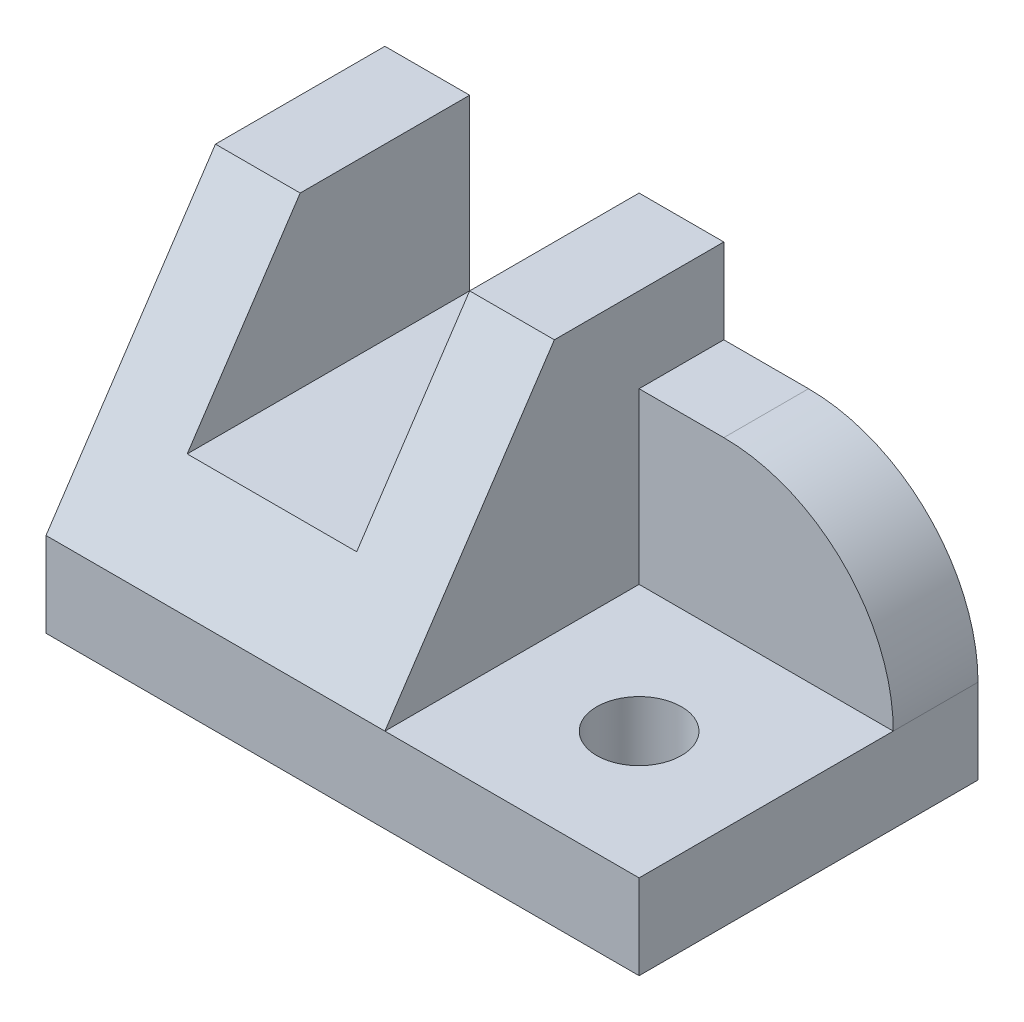
ISO-10303-21;
HEADER;
FILE_DESCRIPTION(('STEP AP214'),'2;1');
FILE_NAME('part.step','',(''),(''),'','','');
FILE_SCHEMA(('AUTOMOTIVE_DESIGN { 1 0 10303 214 1 1 1 1 }'));
ENDSEC;
DATA;
#1=APPLICATION_CONTEXT('core data for automotive mechanical design processes');
#2=APPLICATION_PROTOCOL_DEFINITION('international standard','automotive_design',2000,#1);
#3=PRODUCT_CONTEXT('',#1,'mechanical');
#4=PRODUCT('Part','Part','',(#3));
#5=PRODUCT_RELATED_PRODUCT_CATEGORY('part','',(#4));
#6=PRODUCT_DEFINITION_FORMATION('','',#4);
#7=PRODUCT_DEFINITION_CONTEXT('part definition',#1,'design');
#8=PRODUCT_DEFINITION('design','',#6,#7);
#9=PRODUCT_DEFINITION_SHAPE('','',#8);
#10=(LENGTH_UNIT() NAMED_UNIT(*) SI_UNIT(.MILLI.,.METRE.));
#11=(NAMED_UNIT(*) PLANE_ANGLE_UNIT() SI_UNIT($,.RADIAN.));
#12=(NAMED_UNIT(*) SI_UNIT($,.STERADIAN.) SOLID_ANGLE_UNIT());
#13=UNCERTAINTY_MEASURE_WITH_UNIT(LENGTH_MEASURE(1.E-05),#10,'distance_accuracy_value','');
#14=(GEOMETRIC_REPRESENTATION_CONTEXT(3) GLOBAL_UNCERTAINTY_ASSIGNED_CONTEXT((#13)) GLOBAL_UNIT_ASSIGNED_CONTEXT((#10,
#11,#12)) REPRESENTATION_CONTEXT('',''));
#15=CARTESIAN_POINT('',(0.,0.,0.));
#16=DIRECTION('',(0.,0.,1.));
#17=DIRECTION('',(1.,0.,0.));
#18=AXIS2_PLACEMENT_3D('',#15,#16,#17);
#19=CARTESIAN_POINT('',(40.,40.,-40.));
#20=DIRECTION('',(0.,-1.,0.));
#21=DIRECTION('',(0.,0.,-1.));
#22=AXIS2_PLACEMENT_3D('',#19,#20,#21);
#23=PLANE('',#22);
#24=DIRECTION('',(-1.,0.,0.));
#25=VECTOR('',#24,1.);
#26=CARTESIAN_POINT('',(40.,40.,-20.));
#27=LINE('',#26,#25);
#28=CARTESIAN_POINT('',(9.99999999999998,40.,-20.));
#29=VERTEX_POINT('',#28);
#30=CARTESIAN_POINT('',(0.,40.,-20.));
#31=VERTEX_POINT('',#30);
#32=EDGE_CURVE('E228',#29,#31,#27,.T.);
#33=ORIENTED_EDGE('',*,*,#32,.F.);
#34=DIRECTION('',(0.,0.,-1.));
#35=VECTOR('',#34,1.);
#36=CARTESIAN_POINT('',(9.99999999999998,40.,0.));
#37=LINE('',#36,#35);
#38=CARTESIAN_POINT('',(9.99999999999999,40.,-40.));
#39=VERTEX_POINT('',#38);
#40=EDGE_CURVE('E155',#29,#39,#37,.T.);
#41=ORIENTED_EDGE('',*,*,#40,.T.);
#42=DIRECTION('',(1.,0.,0.));
#43=VECTOR('',#42,1.);
#44=CARTESIAN_POINT('',(40.,40.,-40.));
#45=LINE('',#44,#43);
#46=CARTESIAN_POINT('',(0.,40.,-40.));
#47=VERTEX_POINT('',#46);
#48=EDGE_CURVE('E215',#47,#39,#45,.T.);
#49=ORIENTED_EDGE('',*,*,#48,.F.);
#50=DIRECTION('',(0.,0.,1.));
#51=VECTOR('',#50,1.);
#52=CARTESIAN_POINT('',(0.,40.,-40.));
#53=LINE('',#52,#51);
#54=EDGE_CURVE('E217',#47,#31,#53,.T.);
#55=ORIENTED_EDGE('',*,*,#54,.T.);
#56=EDGE_LOOP('',(#33,#41,#49,#55));
#57=FACE_BOUND('',#56,.T.);
#58=ADVANCED_FACE('F33',(#57),#23,.F.);
#59=CARTESIAN_POINT('',(40.,10.,0.));
#60=DIRECTION('',(0.,0.554700196225229,0.832050294337843));
#61=DIRECTION('',(0.,-0.832050294337843,0.554700196225229));
#62=AXIS2_PLACEMENT_3D('',#59,#60,#61);
#63=PLANE('',#62);
#64=DIRECTION('',(0.,-0.832050294337843,0.554700196225229));
#65=VECTOR('',#64,1.);
#66=CARTESIAN_POINT('',(9.99999999999998,10.,0.));
#67=LINE('',#66,#65);
#68=CARTESIAN_POINT('',(9.99999999999998,20.,-6.66666666666666));
#69=VERTEX_POINT('',#68);
#70=EDGE_CURVE('E163',#29,#69,#67,.T.);
#71=ORIENTED_EDGE('',*,*,#70,.F.);
#72=ORIENTED_EDGE('',*,*,#32,.T.);
#73=DIRECTION('',(0.,0.832050294337843,-0.554700196225229));
#74=VECTOR('',#73,1.);
#75=CARTESIAN_POINT('',(0.,10.,0.));
#76=LINE('',#75,#74);
#77=CARTESIAN_POINT('',(0.,10.,0.));
#78=VERTEX_POINT('',#77);
#79=EDGE_CURVE('E220',#78,#31,#76,.T.);
#80=ORIENTED_EDGE('',*,*,#79,.F.);
#81=DIRECTION('',(-1.,0.,0.));
#82=VECTOR('',#81,1.);
#83=CARTESIAN_POINT('',(40.,10.,0.));
#84=LINE('',#83,#82);
#85=CARTESIAN_POINT('',(40.,10.,0.));
#86=VERTEX_POINT('',#85);
#87=EDGE_CURVE('E223',#86,#78,#84,.T.);
#88=ORIENTED_EDGE('',*,*,#87,.F.);
#89=DIRECTION('',(0.,-0.832050294337844,0.554700196225229));
#90=VECTOR('',#89,1.);
#91=CARTESIAN_POINT('',(40.,40.,-20.));
#92=LINE('',#91,#90);
#93=CARTESIAN_POINT('',(40.,40.,-20.));
#94=VERTEX_POINT('',#93);
#95=EDGE_CURVE('E189',#94,#86,#92,.T.);
#96=ORIENTED_EDGE('',*,*,#95,.F.);
#97=CARTESIAN_POINT('',(30.,40.,-20.));
#98=VERTEX_POINT('',#97);
#99=EDGE_CURVE('E224',#94,#98,#27,.T.);
#100=ORIENTED_EDGE('',*,*,#99,.T.);
#101=DIRECTION('',(0.,0.832050294337843,-0.554700196225229));
#102=VECTOR('',#101,1.);
#103=CARTESIAN_POINT('',(30.,10.,0.));
#104=LINE('',#103,#102);
#105=CARTESIAN_POINT('',(30.,20.,-6.66666666666666));
#106=VERTEX_POINT('',#105);
#107=EDGE_CURVE('E158',#106,#98,#104,.T.);
#108=ORIENTED_EDGE('',*,*,#107,.F.);
#109=DIRECTION('',(1.,0.,0.));
#110=VECTOR('',#109,1.);
#111=CARTESIAN_POINT('',(40.,20.,-6.66666666666666));
#112=LINE('',#111,#110);
#113=EDGE_CURVE('E135',#69,#106,#112,.T.);
#114=ORIENTED_EDGE('',*,*,#113,.F.);
#115=EDGE_LOOP('',(#71,#72,#80,#88,#96,#100,#108,#114));
#116=FACE_BOUND('',#115,.T.);
#117=ADVANCED_FACE('F258',(#116),#63,.T.);
#118=CARTESIAN_POINT('',(0.,0.,0.));
#119=DIRECTION('',(1.,0.,0.));
#120=DIRECTION('',(0.,0.,-1.));
#121=AXIS2_PLACEMENT_3D('',#118,#119,#120);
#122=PLANE('',#121);
#123=DIRECTION('',(0.,1.,0.));
#124=VECTOR('',#123,1.);
#125=CARTESIAN_POINT('',(0.,40.,-40.));
#126=LINE('',#125,#124);
#127=CARTESIAN_POINT('',(0.,0.,-40.));
#128=VERTEX_POINT('',#127);
#129=EDGE_CURVE('E212',#128,#47,#126,.T.);
#130=ORIENTED_EDGE('',*,*,#129,.F.);
#131=DIRECTION('',(0.,0.,-1.));
#132=VECTOR('',#131,1.);
#133=CARTESIAN_POINT('',(0.,0.,-40.));
#134=LINE('',#133,#132);
#135=CARTESIAN_POINT('',(0.,0.,0.));
#136=VERTEX_POINT('',#135);
#137=EDGE_CURVE('E169',#136,#128,#134,.T.);
#138=ORIENTED_EDGE('',*,*,#137,.F.);
#139=DIRECTION('',(0.,1.,0.));
#140=VECTOR('',#139,1.);
#141=CARTESIAN_POINT('',(0.,0.,0.));
#142=LINE('',#141,#140);
#143=EDGE_CURVE('E184',#136,#78,#142,.T.);
#144=ORIENTED_EDGE('',*,*,#143,.T.);
#145=ORIENTED_EDGE('',*,*,#79,.T.);
#146=ORIENTED_EDGE('',*,*,#54,.F.);
#147=EDGE_LOOP('',(#130,#138,#144,#145,#146));
#148=FACE_BOUND('',#147,.T.);
#149=ADVANCED_FACE('F271',(#148),#122,.F.);
#150=CARTESIAN_POINT('',(30.,40.,-40.));
#151=VERTEX_POINT('',#150);
#152=CARTESIAN_POINT('',(40.,40.,-40.));
#153=VERTEX_POINT('',#152);
#154=EDGE_CURVE('E214',#151,#153,#45,.T.);
#155=ORIENTED_EDGE('',*,*,#154,.F.);
#156=DIRECTION('',(0.,0.,-1.));
#157=VECTOR('',#156,1.);
#158=CARTESIAN_POINT('',(30.,40.,0.));
#159=LINE('',#158,#157);
#160=EDGE_CURVE('E139',#98,#151,#159,.T.);
#161=ORIENTED_EDGE('',*,*,#160,.F.);
#162=ORIENTED_EDGE('',*,*,#99,.F.);
#163=DIRECTION('',(0.,0.,1.));
#164=VECTOR('',#163,1.);
#165=CARTESIAN_POINT('',(40.,40.,-40.));
#166=LINE('',#165,#164);
#167=EDGE_CURVE('E187',#153,#94,#166,.T.);
#168=ORIENTED_EDGE('',*,*,#167,.F.);
#169=EDGE_LOOP('',(#155,#161,#162,#168));
#170=FACE_BOUND('',#169,.T.);
#171=ADVANCED_FACE('F255',(#170),#23,.F.);
#172=CARTESIAN_POINT('',(0.,0.,-40.));
#173=DIRECTION('',(0.,0.,1.));
#174=DIRECTION('',(0.,-1.,0.));
#175=AXIS2_PLACEMENT_3D('',#172,#173,#174);
#176=PLANE('',#175);
#177=DIRECTION('',(1.,0.,0.));
#178=VECTOR('',#177,1.);
#179=CARTESIAN_POINT('',(40.,30.,-40.));
#180=LINE('',#179,#178);
#181=CARTESIAN_POINT('',(40.,30.,-40.));
#182=VERTEX_POINT('',#181);
#183=CARTESIAN_POINT('',(50.,30.,-40.));
#184=VERTEX_POINT('',#183);
#185=EDGE_CURVE('E205',#182,#184,#180,.T.);
#186=ORIENTED_EDGE('',*,*,#185,.T.);
#187=CARTESIAN_POINT('',(50.,9.99999999999999,-40.));
#188=DIRECTION('',(0.,0.,1.));
#189=DIRECTION('',(0.,-1.,0.));
#190=AXIS2_PLACEMENT_3D('',#187,#188,#189);
#191=CIRCLE('',#190,20.);
#192=CARTESIAN_POINT('',(70.,10.,-40.));
#193=VERTEX_POINT('',#192);
#194=EDGE_CURVE('E48',#184,#193,#191,.F.);
#195=ORIENTED_EDGE('',*,*,#194,.T.);
#196=DIRECTION('',(0.,1.,0.));
#197=VECTOR('',#196,1.);
#198=CARTESIAN_POINT('',(70.,40.,-40.));
#199=LINE('',#198,#197);
#200=CARTESIAN_POINT('',(70.,0.,-40.));
#201=VERTEX_POINT('',#200);
#202=EDGE_CURVE('E207',#201,#193,#199,.T.);
#203=ORIENTED_EDGE('',*,*,#202,.F.);
#204=DIRECTION('',(1.,0.,0.));
#205=VECTOR('',#204,1.);
#206=CARTESIAN_POINT('',(70.,0.,-40.));
#207=LINE('',#206,#205);
#208=EDGE_CURVE('E173',#128,#201,#207,.T.);
#209=ORIENTED_EDGE('',*,*,#208,.F.);
#210=ORIENTED_EDGE('',*,*,#129,.T.);
#211=ORIENTED_EDGE('',*,*,#48,.T.);
#212=DIRECTION('',(0.,1.,0.));
#213=VECTOR('',#212,1.);
#214=CARTESIAN_POINT('',(9.99999999999999,20.,-40.));
#215=LINE('',#214,#213);
#216=CARTESIAN_POINT('',(9.99999999999999,20.,-40.));
#217=VERTEX_POINT('',#216);
#218=EDGE_CURVE('E150',#217,#39,#215,.T.);
#219=ORIENTED_EDGE('',*,*,#218,.F.);
#220=DIRECTION('',(-1.,0.,0.));
#221=VECTOR('',#220,1.);
#222=CARTESIAN_POINT('',(30.,20.,-40.));
#223=LINE('',#222,#221);
#224=CARTESIAN_POINT('',(30.,20.,-40.));
#225=VERTEX_POINT('',#224);
#226=EDGE_CURVE('E132',#225,#217,#223,.T.);
#227=ORIENTED_EDGE('',*,*,#226,.F.);
#228=DIRECTION('',(0.,-1.,0.));
#229=VECTOR('',#228,1.);
#230=CARTESIAN_POINT('',(30.,40.,-40.));
#231=LINE('',#230,#229);
#232=EDGE_CURVE('E142',#151,#225,#231,.T.);
#233=ORIENTED_EDGE('',*,*,#232,.F.);
#234=ORIENTED_EDGE('',*,*,#154,.T.);
#235=DIRECTION('',(0.,1.,0.));
#236=VECTOR('',#235,1.);
#237=CARTESIAN_POINT('',(40.,30.,-40.));
#238=LINE('',#237,#236);
#239=EDGE_CURVE('E201',#182,#153,#238,.T.);
#240=ORIENTED_EDGE('',*,*,#239,.F.);
#241=EDGE_LOOP('',(#186,#195,#203,#209,#210,#211,#219,#227,#233,#234,#240));
#242=FACE_BOUND('',#241,.T.);
#243=ADVANCED_FACE('F148',(#242),#176,.F.);
#244=CARTESIAN_POINT('',(70.,0.,0.));
#245=DIRECTION('',(-1.,0.,0.));
#246=DIRECTION('',(0.,0.,1.));
#247=AXIS2_PLACEMENT_3D('',#244,#245,#246);
#248=PLANE('',#247);
#249=ORIENTED_EDGE('',*,*,#202,.T.);
#250=DIRECTION('',(0.,0.,-1.));
#251=VECTOR('',#250,1.);
#252=CARTESIAN_POINT('',(70.,9.99999999999999,0.));
#253=LINE('',#252,#251);
#254=CARTESIAN_POINT('',(70.,10.,-30.));
#255=VERTEX_POINT('',#254);
#256=EDGE_CURVE('E41',#193,#255,#253,.F.);
#257=ORIENTED_EDGE('',*,*,#256,.T.);
#258=DIRECTION('',(0.,0.,1.));
#259=VECTOR('',#258,1.);
#260=CARTESIAN_POINT('',(70.,10.,0.));
#261=LINE('',#260,#259);
#262=CARTESIAN_POINT('',(70.,10.,0.));
#263=VERTEX_POINT('',#262);
#264=EDGE_CURVE('E170',#255,#263,#261,.T.);
#265=ORIENTED_EDGE('',*,*,#264,.T.);
#266=DIRECTION('',(0.,1.,0.));
#267=VECTOR('',#266,1.);
#268=CARTESIAN_POINT('',(70.,0.,0.));
#269=LINE('',#268,#267);
#270=CARTESIAN_POINT('',(70.,0.,0.));
#271=VERTEX_POINT('',#270);
#272=EDGE_CURVE('E178',#271,#263,#269,.T.);
#273=ORIENTED_EDGE('',*,*,#272,.F.);
#274=DIRECTION('',(0.,0.,1.));
#275=VECTOR('',#274,1.);
#276=CARTESIAN_POINT('',(70.,0.,0.));
#277=LINE('',#276,#275);
#278=EDGE_CURVE('E176',#201,#271,#277,.T.);
#279=ORIENTED_EDGE('',*,*,#278,.F.);
#280=EDGE_LOOP('',(#249,#257,#265,#273,#279));
#281=FACE_BOUND('',#280,.T.);
#282=ADVANCED_FACE('F235',(#281),#248,.F.);
#283=CARTESIAN_POINT('',(40.,30.,-30.));
#284=DIRECTION('',(0.,-1.,0.));
#285=DIRECTION('',(0.,0.,-1.));
#286=AXIS2_PLACEMENT_3D('',#283,#284,#285);
#287=PLANE('',#286);
#288=DIRECTION('',(1.,0.,0.));
#289=VECTOR('',#288,1.);
#290=CARTESIAN_POINT('',(40.,30.,-30.));
#291=LINE('',#290,#289);
#292=CARTESIAN_POINT('',(40.,30.,-30.));
#293=VERTEX_POINT('',#292);
#294=CARTESIAN_POINT('',(50.,30.,-30.));
#295=VERTEX_POINT('',#294);
#296=EDGE_CURVE('E208',#293,#295,#291,.T.);
#297=ORIENTED_EDGE('',*,*,#296,.T.);
#298=DIRECTION('',(0.,0.,-1.));
#299=VECTOR('',#298,1.);
#300=CARTESIAN_POINT('',(50.,30.,-30.));
#301=LINE('',#300,#299);
#302=EDGE_CURVE('E227',#295,#184,#301,.T.);
#303=ORIENTED_EDGE('',*,*,#302,.T.);
#304=ORIENTED_EDGE('',*,*,#185,.F.);
#305=DIRECTION('',(0.,0.,-1.));
#306=VECTOR('',#305,1.);
#307=CARTESIAN_POINT('',(40.,30.,-30.));
#308=LINE('',#307,#306);
#309=EDGE_CURVE('E198',#293,#182,#308,.T.);
#310=ORIENTED_EDGE('',*,*,#309,.F.);
#311=EDGE_LOOP('',(#297,#303,#304,#310));
#312=FACE_BOUND('',#311,.T.);
#313=ADVANCED_FACE('F246',(#312),#287,.F.);
#314=CARTESIAN_POINT('',(40.,10.,-30.));
#315=DIRECTION('',(0.,0.,-1.));
#316=DIRECTION('',(-1.,0.,0.));
#317=AXIS2_PLACEMENT_3D('',#314,#315,#316);
#318=PLANE('',#317);
#319=DIRECTION('',(1.,0.,0.));
#320=VECTOR('',#319,1.);
#321=CARTESIAN_POINT('',(40.,10.,-30.));
#322=LINE('',#321,#320);
#323=CARTESIAN_POINT('',(40.,10.,-30.));
#324=VERTEX_POINT('',#323);
#325=EDGE_CURVE('E204',#324,#255,#322,.T.);
#326=ORIENTED_EDGE('',*,*,#325,.T.);
#327=CARTESIAN_POINT('',(50.,9.99999999999999,-30.));
#328=DIRECTION('',(0.,0.,-1.));
#329=DIRECTION('',(-1.,0.,0.));
#330=AXIS2_PLACEMENT_3D('',#327,#328,#329);
#331=CIRCLE('',#330,20.);
#332=EDGE_CURVE('E11',#255,#295,#331,.F.);
#333=ORIENTED_EDGE('',*,*,#332,.T.);
#334=ORIENTED_EDGE('',*,*,#296,.F.);
#335=DIRECTION('',(0.,1.,0.));
#336=VECTOR('',#335,1.);
#337=CARTESIAN_POINT('',(40.,10.,-30.));
#338=LINE('',#337,#336);
#339=EDGE_CURVE('E195',#324,#293,#338,.T.);
#340=ORIENTED_EDGE('',*,*,#339,.F.);
#341=EDGE_LOOP('',(#326,#333,#334,#340));
#342=FACE_BOUND('',#341,.T.);
#343=ADVANCED_FACE('F243',(#342),#318,.F.);
#344=CARTESIAN_POINT('',(40.,0.,0.));
#345=DIRECTION('',(-1.,0.,0.));
#346=DIRECTION('',(0.,0.,1.));
#347=AXIS2_PLACEMENT_3D('',#344,#345,#346);
#348=PLANE('',#347);
#349=ORIENTED_EDGE('',*,*,#167,.T.);
#350=ORIENTED_EDGE('',*,*,#95,.T.);
#351=DIRECTION('',(0.,0.,-1.));
#352=VECTOR('',#351,1.);
#353=CARTESIAN_POINT('',(40.,10.,0.));
#354=LINE('',#353,#352);
#355=EDGE_CURVE('E192',#86,#324,#354,.T.);
#356=ORIENTED_EDGE('',*,*,#355,.T.);
#357=ORIENTED_EDGE('',*,*,#339,.T.);
#358=ORIENTED_EDGE('',*,*,#309,.T.);
#359=ORIENTED_EDGE('',*,*,#239,.T.);
#360=EDGE_LOOP('',(#349,#350,#356,#357,#358,#359));
#361=FACE_BOUND('',#360,.T.);
#362=ADVANCED_FACE('F251',(#361),#348,.F.);
#363=CARTESIAN_POINT('',(0.,10.,0.));
#364=DIRECTION('',(0.,1.,0.));
#365=DIRECTION('',(0.,0.,1.));
#366=AXIS2_PLACEMENT_3D('',#363,#364,#365);
#367=PLANE('',#366);
#368=CARTESIAN_POINT('',(55.,10.,-15.));
#369=DIRECTION('',(0.,1.,0.));
#370=DIRECTION('',(0.,0.,1.));
#371=AXIS2_PLACEMENT_3D('',#368,#369,#370);
#372=CIRCLE('',#371,4.99999999999998);
#373=CARTESIAN_POINT('',(55.,10.,-10.));
#374=VERTEX_POINT('',#373);
#375=EDGE_CURVE('E146',#374,#374,#372,.T.);
#376=ORIENTED_EDGE('',*,*,#375,.F.);
#377=EDGE_LOOP('',(#376));
#378=FACE_BOUND('',#377,.T.);
#379=ORIENTED_EDGE('',*,*,#325,.F.);
#380=ORIENTED_EDGE('',*,*,#355,.F.);
#381=DIRECTION('',(-1.,0.,0.));
#382=VECTOR('',#381,1.);
#383=CARTESIAN_POINT('',(0.,10.,0.));
#384=LINE('',#383,#382);
#385=EDGE_CURVE('E165',#263,#86,#384,.T.);
#386=ORIENTED_EDGE('',*,*,#385,.F.);
#387=ORIENTED_EDGE('',*,*,#264,.F.);
#388=EDGE_LOOP('',(#379,#380,#386,#387));
#389=FACE_BOUND('',#388,.T.);
#390=ADVANCED_FACE('F241',(#378,#389),#367,.T.);
#391=CARTESIAN_POINT('',(0.,0.,0.));
#392=DIRECTION('',(0.,0.,-1.));
#393=DIRECTION('',(-1.,0.,0.));
#394=AXIS2_PLACEMENT_3D('',#391,#392,#393);
#395=PLANE('',#394);
#396=ORIENTED_EDGE('',*,*,#385,.T.);
#397=ORIENTED_EDGE('',*,*,#87,.T.);
#398=ORIENTED_EDGE('',*,*,#143,.F.);
#399=DIRECTION('',(-1.,0.,0.));
#400=VECTOR('',#399,1.);
#401=CARTESIAN_POINT('',(0.,0.,0.));
#402=LINE('',#401,#400);
#403=EDGE_CURVE('E166',#271,#136,#402,.T.);
#404=ORIENTED_EDGE('',*,*,#403,.F.);
#405=ORIENTED_EDGE('',*,*,#272,.T.);
#406=EDGE_LOOP('',(#396,#397,#398,#404,#405));
#407=FACE_BOUND('',#406,.T.);
#408=ADVANCED_FACE('F262',(#407),#395,.F.);
#409=CARTESIAN_POINT('',(0.,0.,0.));
#410=DIRECTION('',(0.,1.,0.));
#411=DIRECTION('',(0.,0.,1.));
#412=AXIS2_PLACEMENT_3D('',#409,#410,#411);
#413=PLANE('',#412);
#414=CARTESIAN_POINT('',(55.,0.,-15.));
#415=DIRECTION('',(0.,-1.,0.));
#416=DIRECTION('',(0.,0.,-1.));
#417=AXIS2_PLACEMENT_3D('',#414,#415,#416);
#418=CIRCLE('',#417,4.99999999999998);
#419=CARTESIAN_POINT('',(55.,0.,-20.));
#420=VERTEX_POINT('',#419);
#421=EDGE_CURVE('E435',#420,#420,#418,.T.);
#422=ORIENTED_EDGE('',*,*,#421,.F.);
#423=EDGE_LOOP('',(#422));
#424=FACE_BOUND('',#423,.T.);
#425=ORIENTED_EDGE('',*,*,#403,.T.);
#426=ORIENTED_EDGE('',*,*,#137,.T.);
#427=ORIENTED_EDGE('',*,*,#208,.T.);
#428=ORIENTED_EDGE('',*,*,#278,.T.);
#429=EDGE_LOOP('',(#425,#426,#427,#428));
#430=FACE_BOUND('',#429,.T.);
#431=ADVANCED_FACE('F266',(#424,#430),#413,.F.);
#432=CARTESIAN_POINT('',(9.99999999999998,20.,0.));
#433=DIRECTION('',(-1.,0.,0.));
#434=DIRECTION('',(0.,0.,1.));
#435=AXIS2_PLACEMENT_3D('',#432,#433,#434);
#436=PLANE('',#435);
#437=ORIENTED_EDGE('',*,*,#70,.T.);
#438=DIRECTION('',(0.,0.,-1.));
#439=VECTOR('',#438,1.);
#440=CARTESIAN_POINT('',(9.99999999999998,20.,0.));
#441=LINE('',#440,#439);
#442=EDGE_CURVE('E138',#69,#217,#441,.T.);
#443=ORIENTED_EDGE('',*,*,#442,.T.);
#444=ORIENTED_EDGE('',*,*,#218,.T.);
#445=ORIENTED_EDGE('',*,*,#40,.F.);
#446=EDGE_LOOP('',(#437,#443,#444,#445));
#447=FACE_BOUND('',#446,.T.);
#448=ADVANCED_FACE('F275',(#447),#436,.F.);
#449=CARTESIAN_POINT('',(30.,20.,0.));
#450=DIRECTION('',(0.,-1.,0.));
#451=DIRECTION('',(0.,0.,-1.));
#452=AXIS2_PLACEMENT_3D('',#449,#450,#451);
#453=PLANE('',#452);
#454=ORIENTED_EDGE('',*,*,#113,.T.);
#455=DIRECTION('',(0.,0.,-1.));
#456=VECTOR('',#455,1.);
#457=CARTESIAN_POINT('',(30.,20.,0.));
#458=LINE('',#457,#456);
#459=EDGE_CURVE('E127',#106,#225,#458,.T.);
#460=ORIENTED_EDGE('',*,*,#459,.T.);
#461=ORIENTED_EDGE('',*,*,#226,.T.);
#462=ORIENTED_EDGE('',*,*,#442,.F.);
#463=EDGE_LOOP('',(#454,#460,#461,#462));
#464=FACE_BOUND('',#463,.T.);
#465=ADVANCED_FACE('F129',(#464),#453,.F.);
#466=CARTESIAN_POINT('',(30.,40.,0.));
#467=DIRECTION('',(1.,0.,0.));
#468=DIRECTION('',(0.,0.,-1.));
#469=AXIS2_PLACEMENT_3D('',#466,#467,#468);
#470=PLANE('',#469);
#471=ORIENTED_EDGE('',*,*,#107,.T.);
#472=ORIENTED_EDGE('',*,*,#160,.T.);
#473=ORIENTED_EDGE('',*,*,#232,.T.);
#474=ORIENTED_EDGE('',*,*,#459,.F.);
#475=EDGE_LOOP('',(#471,#472,#473,#474));
#476=FACE_BOUND('',#475,.T.);
#477=ADVANCED_FACE('F143',(#476),#470,.F.);
#478=CARTESIAN_POINT('',(55.,0.,-15.));
#479=DIRECTION('',(0.,-1.,0.));
#480=DIRECTION('',(0.,0.,-1.));
#481=AXIS2_PLACEMENT_3D('',#478,#479,#480);
#482=CYLINDRICAL_SURFACE('',#481,4.99999999999998);
#483=ORIENTED_EDGE('',*,*,#375,.T.);
#484=EDGE_LOOP('',(#483));
#485=FACE_BOUND('',#484,.T.);
#486=ORIENTED_EDGE('',*,*,#421,.T.);
#487=EDGE_LOOP('',(#486));
#488=FACE_BOUND('',#487,.T.);
#489=ADVANCED_FACE('F335',(#485,#488),#482,.F.);
#490=CARTESIAN_POINT('',(50.,9.99999999999999,-30.));
#491=DIRECTION('',(0.,0.,-1.));
#492=DIRECTION('',(-1.,0.,0.));
#493=AXIS2_PLACEMENT_3D('',#490,#491,#492);
#494=CYLINDRICAL_SURFACE('',#493,20.);
#495=ORIENTED_EDGE('',*,*,#332,.F.);
#496=ORIENTED_EDGE('',*,*,#256,.F.);
#497=ORIENTED_EDGE('',*,*,#194,.F.);
#498=ORIENTED_EDGE('',*,*,#302,.F.);
#499=EDGE_LOOP('',(#495,#496,#497,#498));
#500=FACE_BOUND('',#499,.T.);
#501=ADVANCED_FACE('F35',(#500),#494,.T.);
#502=CLOSED_SHELL('',(#58,#117,#149,#171,#243,#282,#313,#343,#362,#390,#408,#431,#448,#465,#477,
#489,#501));
#503=MANIFOLD_SOLID_BREP('B2',#502);
#504=ADVANCED_BREP_SHAPE_REPRESENTATION('',(#18,#503),#14);
#505=SHAPE_DEFINITION_REPRESENTATION(#9,#504);
ENDSEC;
END-ISO-10303-21;
